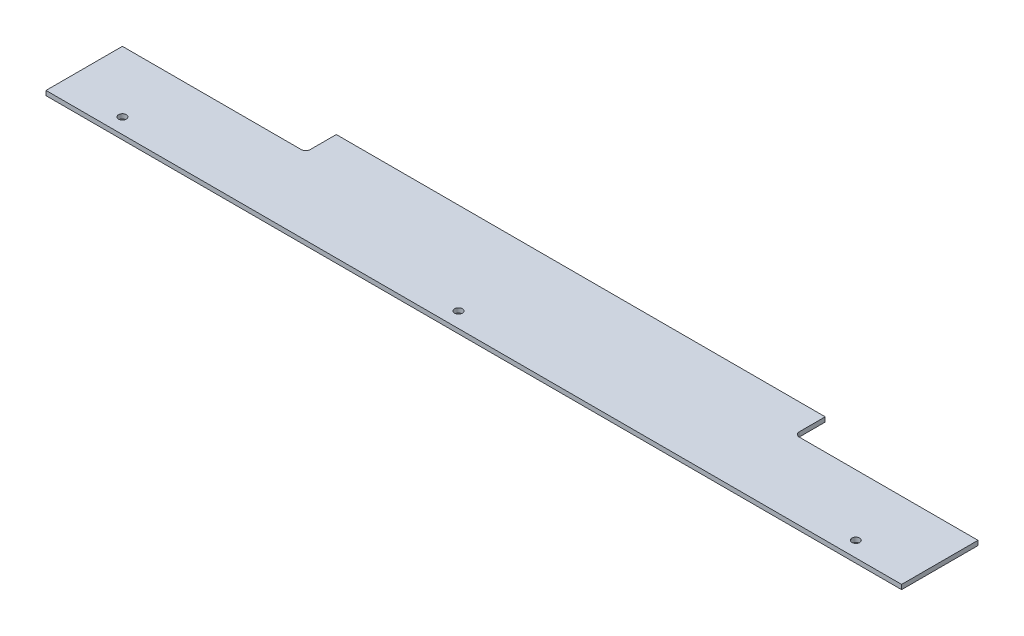
ISO-10303-21;
HEADER;
FILE_DESCRIPTION(('STEP AP214'),'2;1');
FILE_NAME('part.step','',(''),(''),'','','');
FILE_SCHEMA(('AUTOMOTIVE_DESIGN { 1 0 10303 214 1 1 1 1 }'));
ENDSEC;
DATA;
#1=APPLICATION_CONTEXT('core data for automotive mechanical design processes');
#2=APPLICATION_PROTOCOL_DEFINITION('international standard','automotive_design',2000,#1);
#3=PRODUCT_CONTEXT('',#1,'mechanical');
#4=PRODUCT('Part','Part','',(#3));
#5=PRODUCT_RELATED_PRODUCT_CATEGORY('part','',(#4));
#6=PRODUCT_DEFINITION_FORMATION('','',#4);
#7=PRODUCT_DEFINITION_CONTEXT('part definition',#1,'design');
#8=PRODUCT_DEFINITION('design','',#6,#7);
#9=PRODUCT_DEFINITION_SHAPE('','',#8);
#10=(LENGTH_UNIT() NAMED_UNIT(*) SI_UNIT(.MILLI.,.METRE.));
#11=(NAMED_UNIT(*) PLANE_ANGLE_UNIT() SI_UNIT($,.RADIAN.));
#12=(NAMED_UNIT(*) SI_UNIT($,.STERADIAN.) SOLID_ANGLE_UNIT());
#13=UNCERTAINTY_MEASURE_WITH_UNIT(LENGTH_MEASURE(1.E-05),#10,'distance_accuracy_value','');
#14=(GEOMETRIC_REPRESENTATION_CONTEXT(3) GLOBAL_UNCERTAINTY_ASSIGNED_CONTEXT((#13)) GLOBAL_UNIT_ASSIGNED_CONTEXT((#10,
#11,#12)) REPRESENTATION_CONTEXT('',''));
#15=CARTESIAN_POINT('',(0.,0.,0.));
#16=DIRECTION('',(0.,0.,1.));
#17=DIRECTION('',(1.,0.,0.));
#18=AXIS2_PLACEMENT_3D('',#15,#16,#17);
#19=CARTESIAN_POINT('',(-173.,3.,-10.5));
#20=DIRECTION('',(0.,1.,0.));
#21=DIRECTION('',(0.,0.,1.));
#22=AXIS2_PLACEMENT_3D('',#19,#20,#21);
#23=PLANE('',#22);
#24=CARTESIAN_POINT('',(-30.,3.,32.5000000000002));
#25=DIRECTION('',(0.,1.,0.));
#26=DIRECTION('',(0.,0.,1.));
#27=AXIS2_PLACEMENT_3D('',#24,#25,#26);
#28=CIRCLE('',#27,2.54999999999999);
#29=CARTESIAN_POINT('',(-30.,3.,35.0500000000002));
#30=VERTEX_POINT('',#29);
#31=EDGE_CURVE('E214',#30,#30,#28,.T.);
#32=ORIENTED_EDGE('',*,*,#31,.F.);
#33=EDGE_LOOP('',(#32));
#34=FACE_BOUND('',#33,.T.);
#35=CARTESIAN_POINT('',(-173.,3.,-10.5));
#36=DIRECTION('',(0.,-1.,0.));
#37=DIRECTION('',(0.,0.,1.));
#38=AXIS2_PLACEMENT_3D('',#35,#36,#37);
#39=CIRCLE('',#38,3.);
#40=CARTESIAN_POINT('',(-170.,3.,-10.5));
#41=VERTEX_POINT('',#40);
#42=CARTESIAN_POINT('',(-173.,3.,-7.49999999999999));
#43=VERTEX_POINT('',#42);
#44=EDGE_CURVE('E163',#41,#43,#39,.T.);
#45=ORIENTED_EDGE('',*,*,#44,.T.);
#46=DIRECTION('',(-1.,0.,0.));
#47=VECTOR('',#46,1.);
#48=CARTESIAN_POINT('',(-173.,3.,-7.49999999999999));
#49=LINE('',#48,#47);
#50=CARTESIAN_POINT('',(-290.,3.,-7.49999999999998));
#51=VERTEX_POINT('',#50);
#52=EDGE_CURVE('E101',#43,#51,#49,.T.);
#53=ORIENTED_EDGE('',*,*,#52,.T.);
#54=DIRECTION('',(0.,0.,1.));
#55=VECTOR('',#54,1.);
#56=CARTESIAN_POINT('',(-290.,3.,-7.49999999999998));
#57=LINE('',#56,#55);
#58=CARTESIAN_POINT('',(-290.,3.,42.5));
#59=VERTEX_POINT('',#58);
#60=EDGE_CURVE('E184',#51,#59,#57,.T.);
#61=ORIENTED_EDGE('',*,*,#60,.T.);
#62=DIRECTION('',(1.,0.,0.));
#63=VECTOR('',#62,1.);
#64=CARTESIAN_POINT('',(-290.,3.,42.5));
#65=LINE('',#64,#63);
#66=CARTESIAN_POINT('',(270.,3.,42.5));
#67=VERTEX_POINT('',#66);
#68=EDGE_CURVE('E203',#59,#67,#65,.T.);
#69=ORIENTED_EDGE('',*,*,#68,.T.);
#70=DIRECTION('',(0.,0.,-1.));
#71=VECTOR('',#70,1.);
#72=CARTESIAN_POINT('',(270.,3.,-7.50000000000004));
#73=LINE('',#72,#71);
#74=CARTESIAN_POINT('',(270.,3.,-7.50000000000004));
#75=VERTEX_POINT('',#74);
#76=EDGE_CURVE('E200',#67,#75,#73,.T.);
#77=ORIENTED_EDGE('',*,*,#76,.T.);
#78=DIRECTION('',(-1.,0.,0.));
#79=VECTOR('',#78,1.);
#80=CARTESIAN_POINT('',(153.,3.,-7.50000000000004));
#81=LINE('',#80,#79);
#82=CARTESIAN_POINT('',(153.,3.,-7.50000000000004));
#83=VERTEX_POINT('',#82);
#84=EDGE_CURVE('E202',#75,#83,#81,.T.);
#85=ORIENTED_EDGE('',*,*,#84,.T.);
#86=CARTESIAN_POINT('',(153.,3.,-10.5));
#87=DIRECTION('',(0.,-1.,0.));
#88=DIRECTION('',(0.,0.,1.));
#89=AXIS2_PLACEMENT_3D('',#86,#87,#88);
#90=CIRCLE('',#89,3.);
#91=CARTESIAN_POINT('',(150.,3.,-10.5));
#92=VERTEX_POINT('',#91);
#93=EDGE_CURVE('E126',#83,#92,#90,.T.);
#94=ORIENTED_EDGE('',*,*,#93,.T.);
#95=DIRECTION('',(0.,0.,-1.));
#96=VECTOR('',#95,1.);
#97=CARTESIAN_POINT('',(150.,3.,-27.5));
#98=LINE('',#97,#96);
#99=CARTESIAN_POINT('',(150.,3.,-27.5));
#100=VERTEX_POINT('',#99);
#101=EDGE_CURVE('E120',#92,#100,#98,.T.);
#102=ORIENTED_EDGE('',*,*,#101,.T.);
#103=DIRECTION('',(-1.,0.,0.));
#104=VECTOR('',#103,1.);
#105=CARTESIAN_POINT('',(-170.,3.,-27.5));
#106=LINE('',#105,#104);
#107=CARTESIAN_POINT('',(-170.,3.,-27.5));
#108=VERTEX_POINT('',#107);
#109=EDGE_CURVE('E124',#100,#108,#106,.T.);
#110=ORIENTED_EDGE('',*,*,#109,.T.);
#111=DIRECTION('',(0.,0.,1.));
#112=VECTOR('',#111,1.);
#113=CARTESIAN_POINT('',(-170.,3.,-27.5));
#114=LINE('',#113,#112);
#115=EDGE_CURVE('E52',#108,#41,#114,.T.);
#116=ORIENTED_EDGE('',*,*,#115,.T.);
#117=EDGE_LOOP('',(#45,#53,#61,#69,#77,#85,#94,#102,#110,#116));
#118=FACE_BOUND('',#117,.T.);
#119=CARTESIAN_POINT('',(-250.,3.,32.5));
#120=DIRECTION('',(0.,1.,0.));
#121=DIRECTION('',(0.,0.,1.));
#122=AXIS2_PLACEMENT_3D('',#119,#120,#121);
#123=CIRCLE('',#122,2.54999999999999);
#124=CARTESIAN_POINT('',(-250.,3.,35.05));
#125=VERTEX_POINT('',#124);
#126=EDGE_CURVE('E148',#125,#125,#123,.T.);
#127=ORIENTED_EDGE('',*,*,#126,.F.);
#128=EDGE_LOOP('',(#127));
#129=FACE_BOUND('',#128,.T.);
#130=CARTESIAN_POINT('',(230.,3.,32.5));
#131=DIRECTION('',(0.,1.,0.));
#132=DIRECTION('',(0.,0.,1.));
#133=AXIS2_PLACEMENT_3D('',#130,#131,#132);
#134=CIRCLE('',#133,2.54999999999999);
#135=CARTESIAN_POINT('',(230.,3.,35.05));
#136=VERTEX_POINT('',#135);
#137=EDGE_CURVE('E220',#136,#136,#134,.T.);
#138=ORIENTED_EDGE('',*,*,#137,.F.);
#139=EDGE_LOOP('',(#138));
#140=FACE_BOUND('',#139,.T.);
#141=ADVANCED_FACE('F35',(#34,#118,#129,#140),#23,.T.);
#142=CARTESIAN_POINT('',(-173.,0.,-10.5));
#143=DIRECTION('',(0.,1.,0.));
#144=DIRECTION('',(0.,0.,1.));
#145=AXIS2_PLACEMENT_3D('',#142,#143,#144);
#146=PLANE('',#145);
#147=CARTESIAN_POINT('',(-173.,0.,-10.5));
#148=DIRECTION('',(0.,-1.,0.));
#149=DIRECTION('',(0.,0.,1.));
#150=AXIS2_PLACEMENT_3D('',#147,#148,#149);
#151=CIRCLE('',#150,3.);
#152=CARTESIAN_POINT('',(-170.,0.,-10.5));
#153=VERTEX_POINT('',#152);
#154=CARTESIAN_POINT('',(-173.,0.,-7.49999999999999));
#155=VERTEX_POINT('',#154);
#156=EDGE_CURVE('E144',#153,#155,#151,.T.);
#157=ORIENTED_EDGE('',*,*,#156,.F.);
#158=DIRECTION('',(0.,0.,1.));
#159=VECTOR('',#158,1.);
#160=CARTESIAN_POINT('',(-170.,0.,-27.5));
#161=LINE('',#160,#159);
#162=CARTESIAN_POINT('',(-170.,0.,-27.5));
#163=VERTEX_POINT('',#162);
#164=EDGE_CURVE('E93',#163,#153,#161,.T.);
#165=ORIENTED_EDGE('',*,*,#164,.F.);
#166=DIRECTION('',(-1.,0.,0.));
#167=VECTOR('',#166,1.);
#168=CARTESIAN_POINT('',(-170.,0.,-27.5));
#169=LINE('',#168,#167);
#170=CARTESIAN_POINT('',(150.,0.,-27.5));
#171=VERTEX_POINT('',#170);
#172=EDGE_CURVE('E87',#171,#163,#169,.T.);
#173=ORIENTED_EDGE('',*,*,#172,.F.);
#174=DIRECTION('',(0.,0.,-1.));
#175=VECTOR('',#174,1.);
#176=CARTESIAN_POINT('',(150.,0.,-27.5));
#177=LINE('',#176,#175);
#178=CARTESIAN_POINT('',(150.,0.,-10.5));
#179=VERTEX_POINT('',#178);
#180=EDGE_CURVE('E134',#179,#171,#177,.T.);
#181=ORIENTED_EDGE('',*,*,#180,.F.);
#182=CARTESIAN_POINT('',(153.,0.,-10.5));
#183=DIRECTION('',(0.,-1.,0.));
#184=DIRECTION('',(0.,0.,1.));
#185=AXIS2_PLACEMENT_3D('',#182,#183,#184);
#186=CIRCLE('',#185,3.);
#187=CARTESIAN_POINT('',(153.,0.,-7.50000000000004));
#188=VERTEX_POINT('',#187);
#189=EDGE_CURVE('E158',#188,#179,#186,.T.);
#190=ORIENTED_EDGE('',*,*,#189,.F.);
#191=DIRECTION('',(-1.,0.,0.));
#192=VECTOR('',#191,1.);
#193=CARTESIAN_POINT('',(153.,0.,-7.50000000000004));
#194=LINE('',#193,#192);
#195=CARTESIAN_POINT('',(270.,0.,-7.50000000000004));
#196=VERTEX_POINT('',#195);
#197=EDGE_CURVE('E156',#196,#188,#194,.T.);
#198=ORIENTED_EDGE('',*,*,#197,.F.);
#199=DIRECTION('',(0.,0.,-1.));
#200=VECTOR('',#199,1.);
#201=CARTESIAN_POINT('',(270.,0.,-7.50000000000004));
#202=LINE('',#201,#200);
#203=CARTESIAN_POINT('',(270.,0.,42.5));
#204=VERTEX_POINT('',#203);
#205=EDGE_CURVE('E154',#204,#196,#202,.T.);
#206=ORIENTED_EDGE('',*,*,#205,.F.);
#207=DIRECTION('',(1.,0.,0.));
#208=VECTOR('',#207,1.);
#209=CARTESIAN_POINT('',(-290.,0.,42.5));
#210=LINE('',#209,#208);
#211=CARTESIAN_POINT('',(-290.,0.,42.5));
#212=VERTEX_POINT('',#211);
#213=EDGE_CURVE('E152',#212,#204,#210,.T.);
#214=ORIENTED_EDGE('',*,*,#213,.F.);
#215=DIRECTION('',(0.,0.,1.));
#216=VECTOR('',#215,1.);
#217=CARTESIAN_POINT('',(-290.,0.,-7.49999999999998));
#218=LINE('',#217,#216);
#219=CARTESIAN_POINT('',(-290.,0.,-7.49999999999998));
#220=VERTEX_POINT('',#219);
#221=EDGE_CURVE('E150',#220,#212,#218,.T.);
#222=ORIENTED_EDGE('',*,*,#221,.F.);
#223=DIRECTION('',(-1.,0.,0.));
#224=VECTOR('',#223,1.);
#225=CARTESIAN_POINT('',(-173.,0.,-7.49999999999999));
#226=LINE('',#225,#224);
#227=EDGE_CURVE('E147',#155,#220,#226,.T.);
#228=ORIENTED_EDGE('',*,*,#227,.F.);
#229=EDGE_LOOP('',(#157,#165,#173,#181,#190,#198,#206,#214,#222,#228));
#230=FACE_BOUND('',#229,.T.);
#231=CARTESIAN_POINT('',(-250.,0.,32.5));
#232=DIRECTION('',(0.,1.,0.));
#233=DIRECTION('',(0.,0.,1.));
#234=AXIS2_PLACEMENT_3D('',#231,#232,#233);
#235=CIRCLE('',#234,2.54999999999999);
#236=CARTESIAN_POINT('',(-250.,0.,35.05));
#237=VERTEX_POINT('',#236);
#238=EDGE_CURVE('E211',#237,#237,#235,.T.);
#239=ORIENTED_EDGE('',*,*,#238,.T.);
#240=EDGE_LOOP('',(#239));
#241=FACE_BOUND('',#240,.T.);
#242=CARTESIAN_POINT('',(-30.,0.,32.5000000000002));
#243=DIRECTION('',(0.,1.,0.));
#244=DIRECTION('',(0.,0.,1.));
#245=AXIS2_PLACEMENT_3D('',#242,#243,#244);
#246=CIRCLE('',#245,2.54999999999999);
#247=CARTESIAN_POINT('',(-30.,0.,35.0500000000002));
#248=VERTEX_POINT('',#247);
#249=EDGE_CURVE('E217',#248,#248,#246,.T.);
#250=ORIENTED_EDGE('',*,*,#249,.T.);
#251=EDGE_LOOP('',(#250));
#252=FACE_BOUND('',#251,.T.);
#253=CARTESIAN_POINT('',(230.,0.,32.5));
#254=DIRECTION('',(0.,1.,0.));
#255=DIRECTION('',(0.,0.,1.));
#256=AXIS2_PLACEMENT_3D('',#253,#254,#255);
#257=CIRCLE('',#256,2.54999999999999);
#258=CARTESIAN_POINT('',(230.,0.,35.05));
#259=VERTEX_POINT('',#258);
#260=EDGE_CURVE('E223',#259,#259,#257,.T.);
#261=ORIENTED_EDGE('',*,*,#260,.T.);
#262=EDGE_LOOP('',(#261));
#263=FACE_BOUND('',#262,.T.);
#264=ADVANCED_FACE('F188',(#230,#241,#252,#263),#146,.F.);
#265=CARTESIAN_POINT('',(-173.,3.,-10.5));
#266=DIRECTION('',(0.,-1.,0.));
#267=DIRECTION('',(0.,0.,-1.));
#268=AXIS2_PLACEMENT_3D('',#265,#266,#267);
#269=CYLINDRICAL_SURFACE('',#268,3.);
#270=ORIENTED_EDGE('',*,*,#156,.T.);
#271=DIRECTION('',(0.,-1.,0.));
#272=VECTOR('',#271,1.);
#273=CARTESIAN_POINT('',(-173.,3.,-7.49999999999999));
#274=LINE('',#273,#272);
#275=EDGE_CURVE('E11',#43,#155,#274,.T.);
#276=ORIENTED_EDGE('',*,*,#275,.F.);
#277=ORIENTED_EDGE('',*,*,#44,.F.);
#278=DIRECTION('',(0.,-1.,0.));
#279=VECTOR('',#278,1.);
#280=CARTESIAN_POINT('',(-170.,3.,-10.5));
#281=LINE('',#280,#279);
#282=EDGE_CURVE('E140',#41,#153,#281,.T.);
#283=ORIENTED_EDGE('',*,*,#282,.T.);
#284=EDGE_LOOP('',(#270,#276,#277,#283));
#285=FACE_BOUND('',#284,.T.);
#286=ADVANCED_FACE('F37',(#285),#269,.F.);
#287=CARTESIAN_POINT('',(-173.,3.,-7.49999999999999));
#288=DIRECTION('',(0.,0.,1.));
#289=DIRECTION('',(1.,0.,0.));
#290=AXIS2_PLACEMENT_3D('',#287,#288,#289);
#291=PLANE('',#290);
#292=ORIENTED_EDGE('',*,*,#227,.T.);
#293=DIRECTION('',(0.,-1.,0.));
#294=VECTOR('',#293,1.);
#295=CARTESIAN_POINT('',(-290.,3.,-7.49999999999998));
#296=LINE('',#295,#294);
#297=EDGE_CURVE('E44',#51,#220,#296,.T.);
#298=ORIENTED_EDGE('',*,*,#297,.F.);
#299=ORIENTED_EDGE('',*,*,#52,.F.);
#300=ORIENTED_EDGE('',*,*,#275,.T.);
#301=EDGE_LOOP('',(#292,#298,#299,#300));
#302=FACE_BOUND('',#301,.T.);
#303=ADVANCED_FACE('F264',(#302),#291,.F.);
#304=CARTESIAN_POINT('',(-290.,3.,-7.49999999999998));
#305=DIRECTION('',(1.,0.,0.));
#306=DIRECTION('',(0.,0.,-1.));
#307=AXIS2_PLACEMENT_3D('',#304,#305,#306);
#308=PLANE('',#307);
#309=ORIENTED_EDGE('',*,*,#221,.T.);
#310=DIRECTION('',(0.,-1.,0.));
#311=VECTOR('',#310,1.);
#312=CARTESIAN_POINT('',(-290.,3.,42.5));
#313=LINE('',#312,#311);
#314=EDGE_CURVE('E176',#59,#212,#313,.T.);
#315=ORIENTED_EDGE('',*,*,#314,.F.);
#316=ORIENTED_EDGE('',*,*,#60,.F.);
#317=ORIENTED_EDGE('',*,*,#297,.T.);
#318=EDGE_LOOP('',(#309,#315,#316,#317));
#319=FACE_BOUND('',#318,.T.);
#320=ADVANCED_FACE('F182',(#319),#308,.F.);
#321=CARTESIAN_POINT('',(-290.,3.,42.5));
#322=DIRECTION('',(0.,0.,-1.));
#323=DIRECTION('',(-1.,0.,0.));
#324=AXIS2_PLACEMENT_3D('',#321,#322,#323);
#325=PLANE('',#324);
#326=ORIENTED_EDGE('',*,*,#213,.T.);
#327=DIRECTION('',(0.,-1.,0.));
#328=VECTOR('',#327,1.);
#329=CARTESIAN_POINT('',(270.,3.,42.5));
#330=LINE('',#329,#328);
#331=EDGE_CURVE('E173',#67,#204,#330,.T.);
#332=ORIENTED_EDGE('',*,*,#331,.F.);
#333=ORIENTED_EDGE('',*,*,#68,.F.);
#334=ORIENTED_EDGE('',*,*,#314,.T.);
#335=EDGE_LOOP('',(#326,#332,#333,#334));
#336=FACE_BOUND('',#335,.T.);
#337=ADVANCED_FACE('F194',(#336),#325,.F.);
#338=CARTESIAN_POINT('',(270.,3.,-7.50000000000004));
#339=DIRECTION('',(-1.,0.,0.));
#340=DIRECTION('',(0.,0.,1.));
#341=AXIS2_PLACEMENT_3D('',#338,#339,#340);
#342=PLANE('',#341);
#343=ORIENTED_EDGE('',*,*,#205,.T.);
#344=DIRECTION('',(0.,-1.,0.));
#345=VECTOR('',#344,1.);
#346=CARTESIAN_POINT('',(270.,3.,-7.50000000000004));
#347=LINE('',#346,#345);
#348=EDGE_CURVE('E170',#75,#196,#347,.T.);
#349=ORIENTED_EDGE('',*,*,#348,.F.);
#350=ORIENTED_EDGE('',*,*,#76,.F.);
#351=ORIENTED_EDGE('',*,*,#331,.T.);
#352=EDGE_LOOP('',(#343,#349,#350,#351));
#353=FACE_BOUND('',#352,.T.);
#354=ADVANCED_FACE('F198',(#353),#342,.F.);
#355=CARTESIAN_POINT('',(153.,3.,-7.50000000000004));
#356=DIRECTION('',(0.,0.,1.));
#357=DIRECTION('',(1.,0.,0.));
#358=AXIS2_PLACEMENT_3D('',#355,#356,#357);
#359=PLANE('',#358);
#360=ORIENTED_EDGE('',*,*,#197,.T.);
#361=DIRECTION('',(0.,-1.,0.));
#362=VECTOR('',#361,1.);
#363=CARTESIAN_POINT('',(153.,3.,-7.50000000000004));
#364=LINE('',#363,#362);
#365=EDGE_CURVE('E167',#83,#188,#364,.T.);
#366=ORIENTED_EDGE('',*,*,#365,.F.);
#367=ORIENTED_EDGE('',*,*,#84,.F.);
#368=ORIENTED_EDGE('',*,*,#348,.T.);
#369=EDGE_LOOP('',(#360,#366,#367,#368));
#370=FACE_BOUND('',#369,.T.);
#371=ADVANCED_FACE('F254',(#370),#359,.F.);
#372=CARTESIAN_POINT('',(153.,3.,-10.5));
#373=DIRECTION('',(0.,-1.,0.));
#374=DIRECTION('',(0.,0.,-1.));
#375=AXIS2_PLACEMENT_3D('',#372,#373,#374);
#376=CYLINDRICAL_SURFACE('',#375,3.);
#377=ORIENTED_EDGE('',*,*,#189,.T.);
#378=DIRECTION('',(0.,-1.,0.));
#379=VECTOR('',#378,1.);
#380=CARTESIAN_POINT('',(150.,3.,-10.5));
#381=LINE('',#380,#379);
#382=EDGE_CURVE('E135',#92,#179,#381,.T.);
#383=ORIENTED_EDGE('',*,*,#382,.F.);
#384=ORIENTED_EDGE('',*,*,#93,.F.);
#385=ORIENTED_EDGE('',*,*,#365,.T.);
#386=EDGE_LOOP('',(#377,#383,#384,#385));
#387=FACE_BOUND('',#386,.T.);
#388=ADVANCED_FACE('F251',(#387),#376,.F.);
#389=CARTESIAN_POINT('',(150.,3.,-27.5));
#390=DIRECTION('',(-1.,0.,0.));
#391=DIRECTION('',(0.,0.,1.));
#392=AXIS2_PLACEMENT_3D('',#389,#390,#391);
#393=PLANE('',#392);
#394=ORIENTED_EDGE('',*,*,#180,.T.);
#395=DIRECTION('',(0.,-1.,0.));
#396=VECTOR('',#395,1.);
#397=CARTESIAN_POINT('',(150.,3.,-27.5));
#398=LINE('',#397,#396);
#399=EDGE_CURVE('E131',#100,#171,#398,.T.);
#400=ORIENTED_EDGE('',*,*,#399,.F.);
#401=ORIENTED_EDGE('',*,*,#101,.F.);
#402=ORIENTED_EDGE('',*,*,#382,.T.);
#403=EDGE_LOOP('',(#394,#400,#401,#402));
#404=FACE_BOUND('',#403,.T.);
#405=ADVANCED_FACE('F132',(#404),#393,.F.);
#406=CARTESIAN_POINT('',(-170.,3.,-27.5));
#407=DIRECTION('',(0.,0.,1.));
#408=DIRECTION('',(1.,0.,0.));
#409=AXIS2_PLACEMENT_3D('',#406,#407,#408);
#410=PLANE('',#409);
#411=ORIENTED_EDGE('',*,*,#172,.T.);
#412=DIRECTION('',(0.,-1.,0.));
#413=VECTOR('',#412,1.);
#414=CARTESIAN_POINT('',(-170.,3.,-27.5));
#415=LINE('',#414,#413);
#416=EDGE_CURVE('E136',#108,#163,#415,.T.);
#417=ORIENTED_EDGE('',*,*,#416,.F.);
#418=ORIENTED_EDGE('',*,*,#109,.F.);
#419=ORIENTED_EDGE('',*,*,#399,.T.);
#420=EDGE_LOOP('',(#411,#417,#418,#419));
#421=FACE_BOUND('',#420,.T.);
#422=ADVANCED_FACE('F138',(#421),#410,.F.);
#423=CARTESIAN_POINT('',(-170.,3.,-27.5));
#424=DIRECTION('',(1.,0.,0.));
#425=DIRECTION('',(0.,0.,-1.));
#426=AXIS2_PLACEMENT_3D('',#423,#424,#425);
#427=PLANE('',#426);
#428=ORIENTED_EDGE('',*,*,#164,.T.);
#429=ORIENTED_EDGE('',*,*,#282,.F.);
#430=ORIENTED_EDGE('',*,*,#115,.F.);
#431=ORIENTED_EDGE('',*,*,#416,.T.);
#432=EDGE_LOOP('',(#428,#429,#430,#431));
#433=FACE_BOUND('',#432,.T.);
#434=ADVANCED_FACE('F244',(#433),#427,.F.);
#435=CARTESIAN_POINT('',(-250.,3.,32.5));
#436=DIRECTION('',(0.,-1.,0.));
#437=DIRECTION('',(0.,0.,-1.));
#438=AXIS2_PLACEMENT_3D('',#435,#436,#437);
#439=CYLINDRICAL_SURFACE('',#438,2.54999999999999);
#440=ORIENTED_EDGE('',*,*,#126,.T.);
#441=EDGE_LOOP('',(#440));
#442=FACE_BOUND('',#441,.T.);
#443=ORIENTED_EDGE('',*,*,#238,.F.);
#444=EDGE_LOOP('',(#443));
#445=FACE_BOUND('',#444,.T.);
#446=ADVANCED_FACE('F241',(#442,#445),#439,.F.);
#447=CARTESIAN_POINT('',(-30.,3.,32.5000000000002));
#448=DIRECTION('',(0.,-1.,0.));
#449=DIRECTION('',(0.,0.,-1.));
#450=AXIS2_PLACEMENT_3D('',#447,#448,#449);
#451=CYLINDRICAL_SURFACE('',#450,2.54999999999999);
#452=ORIENTED_EDGE('',*,*,#31,.T.);
#453=EDGE_LOOP('',(#452));
#454=FACE_BOUND('',#453,.T.);
#455=ORIENTED_EDGE('',*,*,#249,.F.);
#456=EDGE_LOOP('',(#455));
#457=FACE_BOUND('',#456,.T.);
#458=ADVANCED_FACE('F340',(#454,#457),#451,.F.);
#459=CARTESIAN_POINT('',(230.,3.,32.5));
#460=DIRECTION('',(0.,-1.,0.));
#461=DIRECTION('',(0.,0.,-1.));
#462=AXIS2_PLACEMENT_3D('',#459,#460,#461);
#463=CYLINDRICAL_SURFACE('',#462,2.54999999999999);
#464=ORIENTED_EDGE('',*,*,#137,.T.);
#465=EDGE_LOOP('',(#464));
#466=FACE_BOUND('',#465,.T.);
#467=ORIENTED_EDGE('',*,*,#260,.F.);
#468=EDGE_LOOP('',(#467));
#469=FACE_BOUND('',#468,.T.);
#470=ADVANCED_FACE('F229',(#466,#469),#463,.F.);
#471=CLOSED_SHELL('',(#141,#264,#286,#303,#320,#337,#354,#371,#388,#405,#422,#434,#446,#458,#470));
#472=MANIFOLD_SOLID_BREP('B2',#471);
#473=ADVANCED_BREP_SHAPE_REPRESENTATION('',(#18,#472),#14);
#474=SHAPE_DEFINITION_REPRESENTATION(#9,#473);
ENDSEC;
END-ISO-10303-21;
